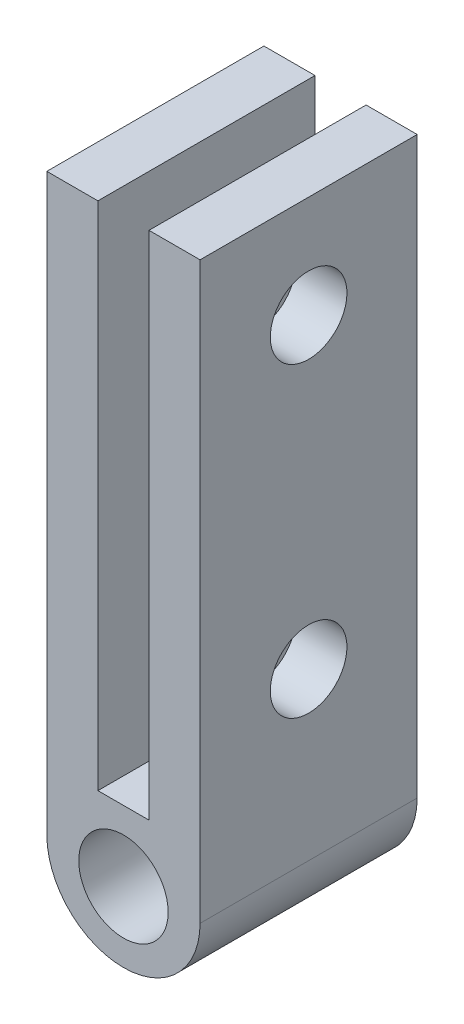
ISO-10303-21;
HEADER;
FILE_DESCRIPTION(('STEP AP214'),'2;1');
FILE_NAME('part.step','',(''),(''),'','','');
FILE_SCHEMA(('AUTOMOTIVE_DESIGN { 1 0 10303 214 1 1 1 1 }'));
ENDSEC;
DATA;
#1=APPLICATION_CONTEXT('core data for automotive mechanical design processes');
#2=APPLICATION_PROTOCOL_DEFINITION('international standard','automotive_design',2000,#1);
#3=PRODUCT_CONTEXT('',#1,'mechanical');
#4=PRODUCT('Part','Part','',(#3));
#5=PRODUCT_RELATED_PRODUCT_CATEGORY('part','',(#4));
#6=PRODUCT_DEFINITION_FORMATION('','',#4);
#7=PRODUCT_DEFINITION_CONTEXT('part definition',#1,'design');
#8=PRODUCT_DEFINITION('design','',#6,#7);
#9=PRODUCT_DEFINITION_SHAPE('','',#8);
#10=(LENGTH_UNIT() NAMED_UNIT(*) SI_UNIT(.MILLI.,.METRE.));
#11=(NAMED_UNIT(*) PLANE_ANGLE_UNIT() SI_UNIT($,.RADIAN.));
#12=(NAMED_UNIT(*) SI_UNIT($,.STERADIAN.) SOLID_ANGLE_UNIT());
#13=UNCERTAINTY_MEASURE_WITH_UNIT(LENGTH_MEASURE(1.E-05),#10,'distance_accuracy_value','');
#14=(GEOMETRIC_REPRESENTATION_CONTEXT(3) GLOBAL_UNCERTAINTY_ASSIGNED_CONTEXT((#13)) GLOBAL_UNIT_ASSIGNED_CONTEXT((#10,
#11,#12)) REPRESENTATION_CONTEXT('',''));
#15=CARTESIAN_POINT('',(0.,0.,0.));
#16=DIRECTION('',(0.,0.,1.));
#17=DIRECTION('',(1.,0.,0.));
#18=AXIS2_PLACEMENT_3D('',#15,#16,#17);
#19=CARTESIAN_POINT('',(0.,0.,8.5));
#20=DIRECTION('',(0.,0.,1.));
#21=DIRECTION('',(1.,0.,0.));
#22=AXIS2_PLACEMENT_3D('',#19,#20,#21);
#23=PLANE('',#22);
#24=DIRECTION('',(0.,-1.,0.));
#25=VECTOR('',#24,1.);
#26=CARTESIAN_POINT('',(-3.,20.,8.5));
#27=LINE('',#26,#25);
#28=CARTESIAN_POINT('',(-3.,20.,8.5));
#29=VERTEX_POINT('',#28);
#30=CARTESIAN_POINT('',(-3.,-2.5,8.5));
#31=VERTEX_POINT('',#30);
#32=EDGE_CURVE('E111',#29,#31,#27,.T.);
#33=ORIENTED_EDGE('',*,*,#32,.T.);
#34=CARTESIAN_POINT('',(0.,-2.5,8.5));
#35=DIRECTION('',(0.,0.,1.));
#36=DIRECTION('',(1.,0.,0.));
#37=AXIS2_PLACEMENT_3D('',#34,#35,#36);
#38=CIRCLE('',#37,3.);
#39=CARTESIAN_POINT('',(0.,-5.5,8.5));
#40=VERTEX_POINT('',#39);
#41=EDGE_CURVE('E42',#31,#40,#38,.T.);
#42=ORIENTED_EDGE('',*,*,#41,.T.);
#43=CARTESIAN_POINT('',(0.,-2.5,8.5));
#44=DIRECTION('',(0.,0.,1.));
#45=DIRECTION('',(1.,0.,0.));
#46=AXIS2_PLACEMENT_3D('',#43,#44,#45);
#47=CIRCLE('',#46,3.);
#48=CARTESIAN_POINT('',(3.,-2.5,8.5));
#49=VERTEX_POINT('',#48);
#50=EDGE_CURVE('E50',#40,#49,#47,.T.);
#51=ORIENTED_EDGE('',*,*,#50,.T.);
#52=DIRECTION('',(0.,1.,0.));
#53=VECTOR('',#52,1.);
#54=CARTESIAN_POINT('',(3.,20.,8.5));
#55=LINE('',#54,#53);
#56=CARTESIAN_POINT('',(3.,20.,8.5));
#57=VERTEX_POINT('',#56);
#58=EDGE_CURVE('E174',#49,#57,#55,.T.);
#59=ORIENTED_EDGE('',*,*,#58,.T.);
#60=DIRECTION('',(-1.,0.,0.));
#61=VECTOR('',#60,1.);
#62=CARTESIAN_POINT('',(1.,20.,8.5));
#63=LINE('',#62,#61);
#64=CARTESIAN_POINT('',(1.,20.,8.5));
#65=VERTEX_POINT('',#64);
#66=EDGE_CURVE('E176',#57,#65,#63,.T.);
#67=ORIENTED_EDGE('',*,*,#66,.T.);
#68=DIRECTION('',(0.,-1.,0.));
#69=VECTOR('',#68,1.);
#70=CARTESIAN_POINT('',(1.,0.,8.5));
#71=LINE('',#70,#69);
#72=CARTESIAN_POINT('',(1.,0.,8.5));
#73=VERTEX_POINT('',#72);
#74=EDGE_CURVE('E178',#65,#73,#71,.T.);
#75=ORIENTED_EDGE('',*,*,#74,.T.);
#76=DIRECTION('',(-1.,0.,0.));
#77=VECTOR('',#76,1.);
#78=CARTESIAN_POINT('',(1.,0.,8.5));
#79=LINE('',#78,#77);
#80=CARTESIAN_POINT('',(-1.,0.,8.5));
#81=VERTEX_POINT('',#80);
#82=EDGE_CURVE('E117',#73,#81,#79,.T.);
#83=ORIENTED_EDGE('',*,*,#82,.T.);
#84=DIRECTION('',(0.,1.,0.));
#85=VECTOR('',#84,1.);
#86=CARTESIAN_POINT('',(-1.,0.,8.5));
#87=LINE('',#86,#85);
#88=CARTESIAN_POINT('',(-1.,20.,8.5));
#89=VERTEX_POINT('',#88);
#90=EDGE_CURVE('E112',#81,#89,#87,.T.);
#91=ORIENTED_EDGE('',*,*,#90,.T.);
#92=DIRECTION('',(-1.,0.,0.));
#93=VECTOR('',#92,1.);
#94=CARTESIAN_POINT('',(-1.,20.,8.5));
#95=LINE('',#94,#93);
#96=EDGE_CURVE('E102',#89,#29,#95,.T.);
#97=ORIENTED_EDGE('',*,*,#96,.T.);
#98=EDGE_LOOP('',(#33,#42,#51,#59,#67,#75,#83,#91,#97));
#99=FACE_BOUND('',#98,.T.);
#100=CARTESIAN_POINT('',(0.,-2.75,8.5));
#101=DIRECTION('',(0.,0.,1.));
#102=DIRECTION('',(1.,0.,0.));
#103=AXIS2_PLACEMENT_3D('',#100,#101,#102);
#104=CIRCLE('',#103,1.75);
#105=CARTESIAN_POINT('',(1.75,-2.75,8.5));
#106=VERTEX_POINT('',#105);
#107=EDGE_CURVE('E168',#106,#106,#104,.T.);
#108=ORIENTED_EDGE('',*,*,#107,.F.);
#109=EDGE_LOOP('',(#108));
#110=FACE_BOUND('',#109,.T.);
#111=ADVANCED_FACE('F33',(#99,#110),#23,.T.);
#112=CARTESIAN_POINT('',(0.,0.,0.));
#113=DIRECTION('',(0.,0.,1.));
#114=DIRECTION('',(1.,0.,0.));
#115=AXIS2_PLACEMENT_3D('',#112,#113,#114);
#116=PLANE('',#115);
#117=CARTESIAN_POINT('',(0.,-2.5,0.));
#118=DIRECTION('',(0.,0.,1.));
#119=DIRECTION('',(1.,0.,0.));
#120=AXIS2_PLACEMENT_3D('',#117,#118,#119);
#121=CIRCLE('',#120,3.);
#122=CARTESIAN_POINT('',(3.,-2.5,0.));
#123=VERTEX_POINT('',#122);
#124=CARTESIAN_POINT('',(0.,-5.5,0.));
#125=VERTEX_POINT('',#124);
#126=EDGE_CURVE('E126',#123,#125,#121,.F.);
#127=ORIENTED_EDGE('',*,*,#126,.T.);
#128=CARTESIAN_POINT('',(0.,-2.5,0.));
#129=DIRECTION('',(0.,0.,1.));
#130=DIRECTION('',(1.,0.,0.));
#131=AXIS2_PLACEMENT_3D('',#128,#129,#130);
#132=CIRCLE('',#131,3.);
#133=CARTESIAN_POINT('',(-3.,-2.5,0.));
#134=VERTEX_POINT('',#133);
#135=EDGE_CURVE('E128',#125,#134,#132,.F.);
#136=ORIENTED_EDGE('',*,*,#135,.T.);
#137=DIRECTION('',(0.,-1.,0.));
#138=VECTOR('',#137,1.);
#139=CARTESIAN_POINT('',(-3.,20.,0.));
#140=LINE('',#139,#138);
#141=CARTESIAN_POINT('',(-3.,20.,0.));
#142=VERTEX_POINT('',#141);
#143=EDGE_CURVE('E185',#142,#134,#140,.T.);
#144=ORIENTED_EDGE('',*,*,#143,.F.);
#145=DIRECTION('',(-1.,0.,0.));
#146=VECTOR('',#145,1.);
#147=CARTESIAN_POINT('',(-1.,20.,0.));
#148=LINE('',#147,#146);
#149=CARTESIAN_POINT('',(-1.,20.,0.));
#150=VERTEX_POINT('',#149);
#151=EDGE_CURVE('E183',#150,#142,#148,.T.);
#152=ORIENTED_EDGE('',*,*,#151,.F.);
#153=DIRECTION('',(0.,1.,0.));
#154=VECTOR('',#153,1.);
#155=CARTESIAN_POINT('',(-1.,0.,0.));
#156=LINE('',#155,#154);
#157=CARTESIAN_POINT('',(-1.,0.,0.));
#158=VERTEX_POINT('',#157);
#159=EDGE_CURVE('E125',#158,#150,#156,.T.);
#160=ORIENTED_EDGE('',*,*,#159,.F.);
#161=DIRECTION('',(-1.,0.,0.));
#162=VECTOR('',#161,1.);
#163=CARTESIAN_POINT('',(1.,0.,0.));
#164=LINE('',#163,#162);
#165=CARTESIAN_POINT('',(1.,0.,0.));
#166=VERTEX_POINT('',#165);
#167=EDGE_CURVE('E121',#166,#158,#164,.T.);
#168=ORIENTED_EDGE('',*,*,#167,.F.);
#169=DIRECTION('',(0.,-1.,0.));
#170=VECTOR('',#169,1.);
#171=CARTESIAN_POINT('',(1.,0.,0.));
#172=LINE('',#171,#170);
#173=CARTESIAN_POINT('',(1.,20.,0.));
#174=VERTEX_POINT('',#173);
#175=EDGE_CURVE('E192',#174,#166,#172,.T.);
#176=ORIENTED_EDGE('',*,*,#175,.F.);
#177=DIRECTION('',(-1.,0.,0.));
#178=VECTOR('',#177,1.);
#179=CARTESIAN_POINT('',(1.,20.,0.));
#180=LINE('',#179,#178);
#181=CARTESIAN_POINT('',(3.,20.,0.));
#182=VERTEX_POINT('',#181);
#183=EDGE_CURVE('E190',#182,#174,#180,.T.);
#184=ORIENTED_EDGE('',*,*,#183,.F.);
#185=DIRECTION('',(0.,1.,0.));
#186=VECTOR('',#185,1.);
#187=CARTESIAN_POINT('',(3.,20.,0.));
#188=LINE('',#187,#186);
#189=EDGE_CURVE('E188',#123,#182,#188,.T.);
#190=ORIENTED_EDGE('',*,*,#189,.F.);
#191=EDGE_LOOP('',(#127,#136,#144,#152,#160,#168,#176,#184,#190));
#192=FACE_BOUND('',#191,.T.);
#193=CARTESIAN_POINT('',(0.,-2.75,0.));
#194=DIRECTION('',(0.,0.,1.));
#195=DIRECTION('',(1.,0.,0.));
#196=AXIS2_PLACEMENT_3D('',#193,#194,#195);
#197=CIRCLE('',#196,1.75);
#198=CARTESIAN_POINT('',(1.75,-2.75,0.));
#199=VERTEX_POINT('',#198);
#200=EDGE_CURVE('E142',#199,#199,#197,.T.);
#201=ORIENTED_EDGE('',*,*,#200,.T.);
#202=EDGE_LOOP('',(#201));
#203=FACE_BOUND('',#202,.T.);
#204=ADVANCED_FACE('F212',(#192,#203),#116,.F.);
#205=CARTESIAN_POINT('',(-1.,0.,8.5));
#206=DIRECTION('',(-1.,0.,0.));
#207=DIRECTION('',(0.,0.,1.));
#208=AXIS2_PLACEMENT_3D('',#205,#206,#207);
#209=PLANE('',#208);
#210=CARTESIAN_POINT('',(-1.,16.,4.25));
#211=DIRECTION('',(-1.,0.,0.));
#212=DIRECTION('',(0.,0.,1.));
#213=AXIS2_PLACEMENT_3D('',#210,#211,#212);
#214=CIRCLE('',#213,1.5);
#215=CARTESIAN_POINT('',(-1.,16.,5.75));
#216=VERTEX_POINT('',#215);
#217=EDGE_CURVE('E143',#216,#216,#214,.T.);
#218=ORIENTED_EDGE('',*,*,#217,.T.);
#219=EDGE_LOOP('',(#218));
#220=FACE_BOUND('',#219,.T.);
#221=CARTESIAN_POINT('',(-1.,4.,4.25));
#222=DIRECTION('',(-1.,0.,0.));
#223=DIRECTION('',(0.,0.,1.));
#224=AXIS2_PLACEMENT_3D('',#221,#222,#223);
#225=CIRCLE('',#224,1.5);
#226=CARTESIAN_POINT('',(-1.,4.,5.75));
#227=VERTEX_POINT('',#226);
#228=EDGE_CURVE('E146',#227,#227,#225,.T.);
#229=ORIENTED_EDGE('',*,*,#228,.T.);
#230=EDGE_LOOP('',(#229));
#231=FACE_BOUND('',#230,.T.);
#232=ORIENTED_EDGE('',*,*,#159,.T.);
#233=DIRECTION('',(0.,0.,-1.));
#234=VECTOR('',#233,1.);
#235=CARTESIAN_POINT('',(-1.,20.,8.5));
#236=LINE('',#235,#234);
#237=EDGE_CURVE('E106',#89,#150,#236,.T.);
#238=ORIENTED_EDGE('',*,*,#237,.F.);
#239=ORIENTED_EDGE('',*,*,#90,.F.);
#240=DIRECTION('',(0.,0.,-1.));
#241=VECTOR('',#240,1.);
#242=CARTESIAN_POINT('',(-1.,0.,8.5));
#243=LINE('',#242,#241);
#244=EDGE_CURVE('E181',#81,#158,#243,.T.);
#245=ORIENTED_EDGE('',*,*,#244,.T.);
#246=EDGE_LOOP('',(#232,#238,#239,#245));
#247=FACE_BOUND('',#246,.T.);
#248=ADVANCED_FACE('F123',(#220,#231,#247),#209,.F.);
#249=CARTESIAN_POINT('',(-1.,20.,8.5));
#250=DIRECTION('',(0.,-1.,0.));
#251=DIRECTION('',(0.,0.,-1.));
#252=AXIS2_PLACEMENT_3D('',#249,#250,#251);
#253=PLANE('',#252);
#254=ORIENTED_EDGE('',*,*,#151,.T.);
#255=DIRECTION('',(0.,0.,-1.));
#256=VECTOR('',#255,1.);
#257=CARTESIAN_POINT('',(-3.,20.,8.5));
#258=LINE('',#257,#256);
#259=EDGE_CURVE('E109',#29,#142,#258,.T.);
#260=ORIENTED_EDGE('',*,*,#259,.F.);
#261=ORIENTED_EDGE('',*,*,#96,.F.);
#262=ORIENTED_EDGE('',*,*,#237,.T.);
#263=EDGE_LOOP('',(#254,#260,#261,#262));
#264=FACE_BOUND('',#263,.T.);
#265=ADVANCED_FACE('F104',(#264),#253,.F.);
#266=CARTESIAN_POINT('',(-3.,20.,8.5));
#267=DIRECTION('',(1.,0.,0.));
#268=DIRECTION('',(0.,1.,0.));
#269=AXIS2_PLACEMENT_3D('',#266,#267,#268);
#270=PLANE('',#269);
#271=CARTESIAN_POINT('',(-3.,16.,4.25));
#272=DIRECTION('',(1.,0.,0.));
#273=DIRECTION('',(0.,1.,0.));
#274=AXIS2_PLACEMENT_3D('',#271,#272,#273);
#275=CIRCLE('',#274,1.5);
#276=CARTESIAN_POINT('',(-3.,17.5,4.25));
#277=VERTEX_POINT('',#276);
#278=EDGE_CURVE('E147',#277,#277,#275,.T.);
#279=ORIENTED_EDGE('',*,*,#278,.T.);
#280=EDGE_LOOP('',(#279));
#281=FACE_BOUND('',#280,.T.);
#282=CARTESIAN_POINT('',(-3.,4.,4.25));
#283=DIRECTION('',(1.,0.,0.));
#284=DIRECTION('',(0.,1.,0.));
#285=AXIS2_PLACEMENT_3D('',#282,#283,#284);
#286=CIRCLE('',#285,1.5);
#287=CARTESIAN_POINT('',(-3.,5.5,4.25));
#288=VERTEX_POINT('',#287);
#289=EDGE_CURVE('E158',#288,#288,#286,.T.);
#290=ORIENTED_EDGE('',*,*,#289,.T.);
#291=EDGE_LOOP('',(#290));
#292=FACE_BOUND('',#291,.T.);
#293=ORIENTED_EDGE('',*,*,#143,.T.);
#294=DIRECTION('',(0.,0.,-1.));
#295=VECTOR('',#294,1.);
#296=CARTESIAN_POINT('',(-3.,-2.5,8.5));
#297=LINE('',#296,#295);
#298=EDGE_CURVE('E135',#134,#31,#297,.F.);
#299=ORIENTED_EDGE('',*,*,#298,.T.);
#300=ORIENTED_EDGE('',*,*,#32,.F.);
#301=ORIENTED_EDGE('',*,*,#259,.T.);
#302=EDGE_LOOP('',(#293,#299,#300,#301));
#303=FACE_BOUND('',#302,.T.);
#304=ADVANCED_FACE('F224',(#281,#292,#303),#270,.F.);
#305=CARTESIAN_POINT('',(3.,20.,8.5));
#306=DIRECTION('',(-1.,0.,0.));
#307=DIRECTION('',(0.,-1.,0.));
#308=AXIS2_PLACEMENT_3D('',#305,#306,#307);
#309=PLANE('',#308);
#310=CARTESIAN_POINT('',(3.,16.,4.25));
#311=DIRECTION('',(1.,0.,0.));
#312=DIRECTION('',(0.,1.,0.));
#313=AXIS2_PLACEMENT_3D('',#310,#311,#312);
#314=CIRCLE('',#313,1.5);
#315=CARTESIAN_POINT('',(3.,17.5,4.25));
#316=VERTEX_POINT('',#315);
#317=EDGE_CURVE('E153',#316,#316,#314,.T.);
#318=ORIENTED_EDGE('',*,*,#317,.F.);
#319=EDGE_LOOP('',(#318));
#320=FACE_BOUND('',#319,.T.);
#321=CARTESIAN_POINT('',(3.,4.,4.25));
#322=DIRECTION('',(1.,0.,0.));
#323=DIRECTION('',(0.,1.,0.));
#324=AXIS2_PLACEMENT_3D('',#321,#322,#323);
#325=CIRCLE('',#324,1.5);
#326=CARTESIAN_POINT('',(3.,5.5,4.25));
#327=VERTEX_POINT('',#326);
#328=EDGE_CURVE('E163',#327,#327,#325,.T.);
#329=ORIENTED_EDGE('',*,*,#328,.F.);
#330=EDGE_LOOP('',(#329));
#331=FACE_BOUND('',#330,.T.);
#332=ORIENTED_EDGE('',*,*,#58,.F.);
#333=DIRECTION('',(0.,0.,-1.));
#334=VECTOR('',#333,1.);
#335=CARTESIAN_POINT('',(3.,-2.5,8.5));
#336=LINE('',#335,#334);
#337=EDGE_CURVE('E11',#49,#123,#336,.T.);
#338=ORIENTED_EDGE('',*,*,#337,.T.);
#339=ORIENTED_EDGE('',*,*,#189,.T.);
#340=DIRECTION('',(0.,0.,-1.));
#341=VECTOR('',#340,1.);
#342=CARTESIAN_POINT('',(3.,20.,8.5));
#343=LINE('',#342,#341);
#344=EDGE_CURVE('E130',#57,#182,#343,.T.);
#345=ORIENTED_EDGE('',*,*,#344,.F.);
#346=EDGE_LOOP('',(#332,#338,#339,#345));
#347=FACE_BOUND('',#346,.T.);
#348=ADVANCED_FACE('F232',(#320,#331,#347),#309,.F.);
#349=CARTESIAN_POINT('',(1.,20.,8.5));
#350=DIRECTION('',(0.,-1.,0.));
#351=DIRECTION('',(0.,0.,-1.));
#352=AXIS2_PLACEMENT_3D('',#349,#350,#351);
#353=PLANE('',#352);
#354=ORIENTED_EDGE('',*,*,#183,.T.);
#355=DIRECTION('',(0.,0.,-1.));
#356=VECTOR('',#355,1.);
#357=CARTESIAN_POINT('',(1.,20.,8.5));
#358=LINE('',#357,#356);
#359=EDGE_CURVE('E199',#65,#174,#358,.T.);
#360=ORIENTED_EDGE('',*,*,#359,.F.);
#361=ORIENTED_EDGE('',*,*,#66,.F.);
#362=ORIENTED_EDGE('',*,*,#344,.T.);
#363=EDGE_LOOP('',(#354,#360,#361,#362));
#364=FACE_BOUND('',#363,.T.);
#365=ADVANCED_FACE('F206',(#364),#353,.F.);
#366=CARTESIAN_POINT('',(1.,0.,8.5));
#367=DIRECTION('',(1.,0.,0.));
#368=DIRECTION('',(0.,1.,0.));
#369=AXIS2_PLACEMENT_3D('',#366,#367,#368);
#370=PLANE('',#369);
#371=CARTESIAN_POINT('',(1.,16.,4.25));
#372=DIRECTION('',(1.,0.,0.));
#373=DIRECTION('',(0.,1.,0.));
#374=AXIS2_PLACEMENT_3D('',#371,#372,#373);
#375=CIRCLE('',#374,1.5);
#376=CARTESIAN_POINT('',(1.,17.5,4.25));
#377=VERTEX_POINT('',#376);
#378=EDGE_CURVE('E37',#377,#377,#375,.T.);
#379=ORIENTED_EDGE('',*,*,#378,.T.);
#380=EDGE_LOOP('',(#379));
#381=FACE_BOUND('',#380,.T.);
#382=CARTESIAN_POINT('',(1.,4.,4.25));
#383=DIRECTION('',(1.,0.,0.));
#384=DIRECTION('',(0.,1.,0.));
#385=AXIS2_PLACEMENT_3D('',#382,#383,#384);
#386=CIRCLE('',#385,1.5);
#387=CARTESIAN_POINT('',(1.,5.5,4.25));
#388=VERTEX_POINT('',#387);
#389=EDGE_CURVE('E144',#388,#388,#386,.T.);
#390=ORIENTED_EDGE('',*,*,#389,.T.);
#391=EDGE_LOOP('',(#390));
#392=FACE_BOUND('',#391,.T.);
#393=ORIENTED_EDGE('',*,*,#175,.T.);
#394=DIRECTION('',(0.,0.,-1.));
#395=VECTOR('',#394,1.);
#396=CARTESIAN_POINT('',(1.,0.,8.5));
#397=LINE('',#396,#395);
#398=EDGE_CURVE('E196',#73,#166,#397,.T.);
#399=ORIENTED_EDGE('',*,*,#398,.F.);
#400=ORIENTED_EDGE('',*,*,#74,.F.);
#401=ORIENTED_EDGE('',*,*,#359,.T.);
#402=EDGE_LOOP('',(#393,#399,#400,#401));
#403=FACE_BOUND('',#402,.T.);
#404=ADVANCED_FACE('F218',(#381,#392,#403),#370,.F.);
#405=CARTESIAN_POINT('',(1.,0.,8.5));
#406=DIRECTION('',(0.,-1.,0.));
#407=DIRECTION('',(1.,0.,0.));
#408=AXIS2_PLACEMENT_3D('',#405,#406,#407);
#409=PLANE('',#408);
#410=ORIENTED_EDGE('',*,*,#167,.T.);
#411=ORIENTED_EDGE('',*,*,#244,.F.);
#412=ORIENTED_EDGE('',*,*,#82,.F.);
#413=ORIENTED_EDGE('',*,*,#398,.T.);
#414=EDGE_LOOP('',(#410,#411,#412,#413));
#415=FACE_BOUND('',#414,.T.);
#416=ADVANCED_FACE('F221',(#415),#409,.F.);
#417=CARTESIAN_POINT('',(0.,-2.75,8.5));
#418=DIRECTION('',(0.,0.,-1.));
#419=DIRECTION('',(-1.,0.,0.));
#420=AXIS2_PLACEMENT_3D('',#417,#418,#419);
#421=CYLINDRICAL_SURFACE('',#420,1.75);
#422=ORIENTED_EDGE('',*,*,#107,.T.);
#423=EDGE_LOOP('',(#422));
#424=FACE_BOUND('',#423,.T.);
#425=ORIENTED_EDGE('',*,*,#200,.F.);
#426=EDGE_LOOP('',(#425));
#427=FACE_BOUND('',#426,.T.);
#428=ADVANCED_FACE('F252',(#424,#427),#421,.F.);
#429=CARTESIAN_POINT('',(0.,-2.5,8.5));
#430=DIRECTION('',(0.,0.,-1.));
#431=DIRECTION('',(-1.,0.,0.));
#432=AXIS2_PLACEMENT_3D('',#429,#430,#431);
#433=CYLINDRICAL_SURFACE('',#432,3.);
#434=ORIENTED_EDGE('',*,*,#337,.F.);
#435=ORIENTED_EDGE('',*,*,#50,.F.);
#436=DIRECTION('',(0.,0.,-1.));
#437=VECTOR('',#436,1.);
#438=CARTESIAN_POINT('',(0.,-5.5,8.5));
#439=LINE('',#438,#437);
#440=EDGE_CURVE('E140',#125,#40,#439,.F.);
#441=ORIENTED_EDGE('',*,*,#440,.F.);
#442=ORIENTED_EDGE('',*,*,#126,.F.);
#443=EDGE_LOOP('',(#434,#435,#441,#442));
#444=FACE_BOUND('',#443,.T.);
#445=ADVANCED_FACE('F35',(#444),#433,.T.);
#446=CARTESIAN_POINT('',(0.,-2.5,8.5));
#447=DIRECTION('',(0.,0.,-1.));
#448=DIRECTION('',(-1.,0.,0.));
#449=AXIS2_PLACEMENT_3D('',#446,#447,#448);
#450=CYLINDRICAL_SURFACE('',#449,3.);
#451=ORIENTED_EDGE('',*,*,#41,.F.);
#452=ORIENTED_EDGE('',*,*,#298,.F.);
#453=ORIENTED_EDGE('',*,*,#135,.F.);
#454=ORIENTED_EDGE('',*,*,#440,.T.);
#455=EDGE_LOOP('',(#451,#452,#453,#454));
#456=FACE_BOUND('',#455,.T.);
#457=ADVANCED_FACE('F228',(#456),#450,.T.);
#458=CARTESIAN_POINT('',(-3.,4.,4.25));
#459=DIRECTION('',(1.,0.,0.));
#460=DIRECTION('',(0.,1.,0.));
#461=AXIS2_PLACEMENT_3D('',#458,#459,#460);
#462=CYLINDRICAL_SURFACE('',#461,1.5);
#463=ORIENTED_EDGE('',*,*,#328,.T.);
#464=EDGE_LOOP('',(#463));
#465=FACE_BOUND('',#464,.T.);
#466=ORIENTED_EDGE('',*,*,#389,.F.);
#467=EDGE_LOOP('',(#466));
#468=FACE_BOUND('',#467,.T.);
#469=ADVANCED_FACE('F267',(#465,#468),#462,.F.);
#470=CARTESIAN_POINT('',(-3.,16.,4.25));
#471=DIRECTION('',(1.,0.,0.));
#472=DIRECTION('',(0.,1.,0.));
#473=AXIS2_PLACEMENT_3D('',#470,#471,#472);
#474=CYLINDRICAL_SURFACE('',#473,1.5);
#475=ORIENTED_EDGE('',*,*,#317,.T.);
#476=EDGE_LOOP('',(#475));
#477=FACE_BOUND('',#476,.T.);
#478=ORIENTED_EDGE('',*,*,#378,.F.);
#479=EDGE_LOOP('',(#478));
#480=FACE_BOUND('',#479,.T.);
#481=ADVANCED_FACE('F264',(#477,#480),#474,.F.);
#482=ORIENTED_EDGE('',*,*,#289,.F.);
#483=EDGE_LOOP('',(#482));
#484=FACE_BOUND('',#483,.T.);
#485=ORIENTED_EDGE('',*,*,#228,.F.);
#486=EDGE_LOOP('',(#485));
#487=FACE_BOUND('',#486,.T.);
#488=ADVANCED_FACE('F266',(#484,#487),#462,.F.);
#489=ORIENTED_EDGE('',*,*,#278,.F.);
#490=EDGE_LOOP('',(#489));
#491=FACE_BOUND('',#490,.T.);
#492=ORIENTED_EDGE('',*,*,#217,.F.);
#493=EDGE_LOOP('',(#492));
#494=FACE_BOUND('',#493,.T.);
#495=ADVANCED_FACE('F270',(#491,#494),#474,.F.);
#496=CLOSED_SHELL('',(#111,#204,#248,#265,#304,#348,#365,#404,#416,#428,#445,#457,#469,#481,
#488,#495));
#497=MANIFOLD_SOLID_BREP('B2',#496);
#498=ADVANCED_BREP_SHAPE_REPRESENTATION('',(#18,#497),#14);
#499=SHAPE_DEFINITION_REPRESENTATION(#9,#498);
ENDSEC;
END-ISO-10303-21;
